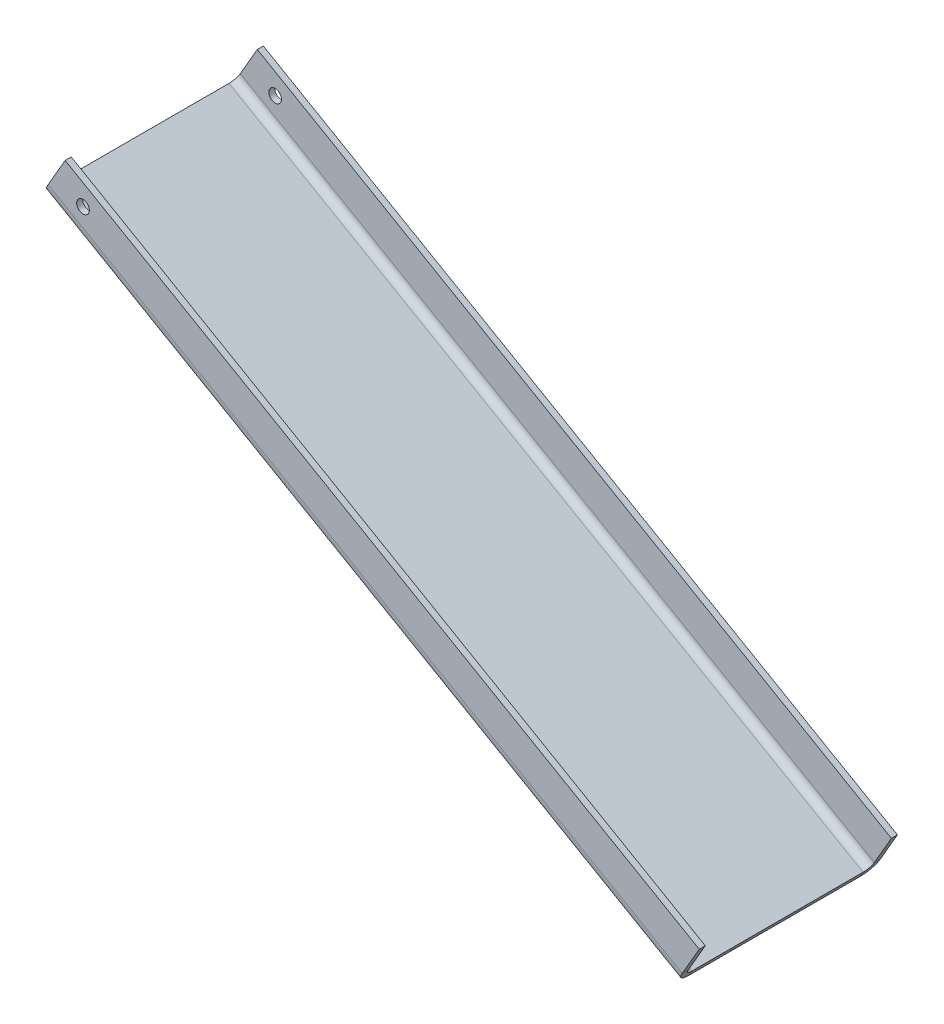
ISO-10303-21;
HEADER;
FILE_DESCRIPTION(('STEP AP214'),'2;1');
FILE_NAME('part.step','',(''),(''),'','','');
FILE_SCHEMA(('AUTOMOTIVE_DESIGN { 1 0 10303 214 1 1 1 1 }'));
ENDSEC;
DATA;
#1=APPLICATION_CONTEXT('core data for automotive mechanical design processes');
#2=APPLICATION_PROTOCOL_DEFINITION('international standard','automotive_design',2000,#1);
#3=PRODUCT_CONTEXT('',#1,'mechanical');
#4=PRODUCT('Part','Part','',(#3));
#5=PRODUCT_RELATED_PRODUCT_CATEGORY('part','',(#4));
#6=PRODUCT_DEFINITION_FORMATION('','',#4);
#7=PRODUCT_DEFINITION_CONTEXT('part definition',#1,'design');
#8=PRODUCT_DEFINITION('design','',#6,#7);
#9=PRODUCT_DEFINITION_SHAPE('','',#8);
#10=(LENGTH_UNIT() NAMED_UNIT(*) SI_UNIT(.MILLI.,.METRE.));
#11=(NAMED_UNIT(*) PLANE_ANGLE_UNIT() SI_UNIT($,.RADIAN.));
#12=(NAMED_UNIT(*) SI_UNIT($,.STERADIAN.) SOLID_ANGLE_UNIT());
#13=UNCERTAINTY_MEASURE_WITH_UNIT(LENGTH_MEASURE(1.E-05),#10,'distance_accuracy_value','');
#14=(GEOMETRIC_REPRESENTATION_CONTEXT(3) GLOBAL_UNCERTAINTY_ASSIGNED_CONTEXT((#13)) GLOBAL_UNIT_ASSIGNED_CONTEXT((#10,
#11,#12)) REPRESENTATION_CONTEXT('',''));
#15=CARTESIAN_POINT('',(0.,0.,0.));
#16=DIRECTION('',(0.,0.,1.));
#17=DIRECTION('',(1.,0.,0.));
#18=AXIS2_PLACEMENT_3D('',#15,#16,#17);
#19=CARTESIAN_POINT('',(3.60822483003176E-13,-7.07767178198537E-13,25.0000000000007));
#20=DIRECTION('',(-0.500000000000012,-0.866025403784438,0.));
#21=DIRECTION('',(0.866025403784455,-0.500000000000001,0.));
#22=AXIS2_PLACEMENT_3D('',#19,#20,#21);
#23=PLANE('',#22);
#24=DIRECTION('',(0.866025403784455,-0.500000000000002,0.));
#25=VECTOR('',#24,1.);
#26=CARTESIAN_POINT('',(160.000000000003,-92.3760430703405,21.5760800000006));
#27=LINE('',#26,#25);
#28=CARTESIAN_POINT('',(160.000000000003,-92.3760430703405,21.5760800000007));
#29=VERTEX_POINT('',#28);
#30=CARTESIAN_POINT('',(2.63677968348475E-13,0.,21.5760800000007));
#31=VERTEX_POINT('',#30);
#32=EDGE_CURVE('E234',#29,#31,#27,.F.);
#33=ORIENTED_EDGE('',*,*,#32,.F.);
#34=DIRECTION('',(0.,0.,-1.00000000000002));
#35=VECTOR('',#34,1.);
#36=CARTESIAN_POINT('',(160.000000000003,-92.3760430703404,25.0000000000007));
#37=LINE('',#36,#35);
#38=CARTESIAN_POINT('',(160.000000000003,-92.3760430703403,-21.5760800000002));
#39=VERTEX_POINT('',#38);
#40=EDGE_CURVE('E15',#29,#39,#37,.T.);
#41=ORIENTED_EDGE('',*,*,#40,.T.);
#42=DIRECTION('',(-0.866025403784456,0.5,0.));
#43=VECTOR('',#42,1.);
#44=CARTESIAN_POINT('',(0.,0.,-21.5760800000004));
#45=LINE('',#44,#43);
#46=CARTESIAN_POINT('',(0.,0.,-21.5760800000004));
#47=VERTEX_POINT('',#46);
#48=EDGE_CURVE('E285',#47,#39,#45,.F.);
#49=ORIENTED_EDGE('',*,*,#48,.F.);
#50=DIRECTION('',(0.,0.,-1.00000000000002));
#51=VECTOR('',#50,1.);
#52=CARTESIAN_POINT('',(3.60822483003176E-13,-7.07767178198537E-13,25.0000000000007));
#53=LINE('',#52,#51);
#54=EDGE_CURVE('E98',#31,#47,#53,.T.);
#55=ORIENTED_EDGE('',*,*,#54,.F.);
#56=EDGE_LOOP('',(#33,#41,#49,#55));
#57=FACE_BOUND('',#56,.T.);
#58=ADVANCED_FACE('F89',(#57),#23,.F.);
#59=CARTESIAN_POINT('',(-0.75945999999967,-1.31542330631626,25.0000000000007));
#60=DIRECTION('',(-0.500000000000012,-0.866025403784438,0.));
#61=DIRECTION('',(0.866025403784455,-0.500000000000001,0.));
#62=AXIS2_PLACEMENT_3D('',#59,#60,#61);
#63=PLANE('',#62);
#64=DIRECTION('',(0.,0.,1.00000000000002));
#65=VECTOR('',#64,1.);
#66=CARTESIAN_POINT('',(159.240540000005,-93.6914663766574,25.0000000000005));
#67=LINE('',#66,#65);
#68=CARTESIAN_POINT('',(159.240540000004,-93.6914663766574,21.5760800000004));
#69=VERTEX_POINT('',#68);
#70=CARTESIAN_POINT('',(159.240540000005,-93.6914663766567,-21.5760800000003));
#71=VERTEX_POINT('',#70);
#72=EDGE_CURVE('E295',#69,#71,#67,.F.);
#73=ORIENTED_EDGE('',*,*,#72,.F.);
#74=DIRECTION('',(0.866025403784455,-0.500000000000002,0.));
#75=VECTOR('',#74,1.);
#76=CARTESIAN_POINT('',(159.240540000004,-93.6914663766574,21.5760800000005));
#77=LINE('',#76,#75);
#78=CARTESIAN_POINT('',(-0.759459999999663,-1.31542330631623,21.5760800000007));
#79=VERTEX_POINT('',#78);
#80=EDGE_CURVE('E223',#69,#79,#77,.F.);
#81=ORIENTED_EDGE('',*,*,#80,.T.);
#82=DIRECTION('',(0.,0.,1.00000000000002));
#83=VECTOR('',#82,1.);
#84=CARTESIAN_POINT('',(-0.75945999999967,-1.31542330631626,25.0000000000007));
#85=LINE('',#84,#83);
#86=CARTESIAN_POINT('',(-0.759459999999889,-1.31542330631634,-21.5760800000003));
#87=VERTEX_POINT('',#86);
#88=EDGE_CURVE('E291',#79,#87,#85,.F.);
#89=ORIENTED_EDGE('',*,*,#88,.T.);
#90=DIRECTION('',(-0.866025403784456,0.5,0.));
#91=VECTOR('',#90,1.);
#92=CARTESIAN_POINT('',(-0.759459999999889,-1.31542330631634,-21.5760800000003));
#93=LINE('',#92,#91);
#94=EDGE_CURVE('E274',#87,#71,#93,.F.);
#95=ORIENTED_EDGE('',*,*,#94,.T.);
#96=EDGE_LOOP('',(#73,#81,#89,#95));
#97=FACE_BOUND('',#96,.T.);
#98=ADVANCED_FACE('F302',(#97),#63,.T.);
#99=CARTESIAN_POINT('',(160.000000000003,-92.3760430703404,25.0000000000007));
#100=DIRECTION('',(-0.866025403784455,0.500000000000001,0.));
#101=DIRECTION('',(0.,0.,-1.00000000000002));
#102=AXIS2_PLACEMENT_3D('',#99,#100,#101);
#103=PLANE('',#102);
#104=ORIENTED_EDGE('',*,*,#40,.F.);
#105=DIRECTION('',(-0.500000000000013,-0.866025403784438,0.));
#106=VECTOR('',#105,1.);
#107=CARTESIAN_POINT('',(160.000000000003,-92.3760430703405,21.5760800000007));
#108=LINE('',#107,#106);
#109=EDGE_CURVE('E228',#29,#69,#108,.T.);
#110=ORIENTED_EDGE('',*,*,#109,.T.);
#111=ORIENTED_EDGE('',*,*,#72,.T.);
#112=DIRECTION('',(-0.500000000000007,-0.866025403784441,0.));
#113=VECTOR('',#112,1.);
#114=CARTESIAN_POINT('',(160.000000000003,-92.3760430703403,-21.5760800000002));
#115=LINE('',#114,#113);
#116=EDGE_CURVE('E289',#39,#71,#115,.T.);
#117=ORIENTED_EDGE('',*,*,#116,.F.);
#118=EDGE_LOOP('',(#104,#110,#111,#117));
#119=FACE_BOUND('',#118,.T.);
#120=ADVANCED_FACE('F340',(#119),#103,.F.);
#121=CARTESIAN_POINT('',(3.60822483003176E-13,-7.07767178198537E-13,25.0000000000007));
#122=DIRECTION('',(-0.866025403784455,0.500000000000001,0.));
#123=DIRECTION('',(0.,0.,-1.00000000000002));
#124=AXIS2_PLACEMENT_3D('',#121,#122,#123);
#125=PLANE('',#124);
#126=DIRECTION('',(-0.50000000000001,-0.866025403784439,0.));
#127=VECTOR('',#126,1.);
#128=CARTESIAN_POINT('',(2.63677968348475E-13,0.,21.5760800000007));
#129=LINE('',#128,#127);
#130=EDGE_CURVE('E239',#31,#79,#129,.T.);
#131=ORIENTED_EDGE('',*,*,#130,.F.);
#132=ORIENTED_EDGE('',*,*,#54,.T.);
#133=DIRECTION('',(-0.500000000000011,-0.866025403784438,0.));
#134=VECTOR('',#133,1.);
#135=CARTESIAN_POINT('',(0.,0.,-21.5760800000004));
#136=LINE('',#135,#134);
#137=EDGE_CURVE('E279',#47,#87,#136,.T.);
#138=ORIENTED_EDGE('',*,*,#137,.T.);
#139=ORIENTED_EDGE('',*,*,#88,.F.);
#140=EDGE_LOOP('',(#131,#132,#138,#139));
#141=FACE_BOUND('',#140,.T.);
#142=ADVANCED_FACE('F91',(#141),#125,.T.);
#143=CARTESIAN_POINT('',(160.952500000004,-90.726264676131,-21.5760800000004));
#144=DIRECTION('',(0.866025403784456,-0.5,0.));
#145=DIRECTION('',(0.500000000000011,0.866025403784438,0.));
#146=AXIS2_PLACEMENT_3D('',#143,#144,#145);
#147=PLANE('',#146);
#148=DIRECTION('',(0.,0.,1.00000000000002));
#149=VECTOR('',#148,1.);
#150=CARTESIAN_POINT('',(160.952500000004,-90.726264676131,-25.0000000000005));
#151=LINE('',#150,#149);
#152=CARTESIAN_POINT('',(160.952500000004,-90.726264676131,-23.4810800000004));
#153=VERTEX_POINT('',#152);
#154=CARTESIAN_POINT('',(160.952500000004,-90.726264676131,-25.0000000000005));
#155=VERTEX_POINT('',#154);
#156=EDGE_CURVE('E241',#153,#155,#151,.F.);
#157=ORIENTED_EDGE('',*,*,#156,.F.);
#158=CARTESIAN_POINT('',(160.952500000004,-90.726264676131,-21.5760800000004));
#159=DIRECTION('',(-0.866025403784456,0.5,0.));
#160=DIRECTION('',(-0.500000000000011,-0.866025403784438,0.));
#161=AXIS2_PLACEMENT_3D('',#158,#159,#160);
#162=CIRCLE('',#161,1.905);
#163=EDGE_CURVE('E282',#39,#153,#162,.F.);
#164=ORIENTED_EDGE('',*,*,#163,.F.);
#165=ORIENTED_EDGE('',*,*,#116,.T.);
#166=CARTESIAN_POINT('',(160.952500000004,-90.726264676131,-21.5760800000004));
#167=DIRECTION('',(-0.866025403784456,0.5,0.));
#168=DIRECTION('',(-0.500000000000011,-0.866025403784438,0.));
#169=AXIS2_PLACEMENT_3D('',#166,#167,#168);
#170=CIRCLE('',#169,3.42392);
#171=EDGE_CURVE('E106',#71,#155,#170,.F.);
#172=ORIENTED_EDGE('',*,*,#171,.T.);
#173=EDGE_LOOP('',(#157,#164,#165,#172));
#174=FACE_BOUND('',#173,.T.);
#175=ADVANCED_FACE('F336',(#174),#147,.T.);
#176=CARTESIAN_POINT('',(0.952500000000182,1.64977839420857,-21.5760800000004));
#177=DIRECTION('',(0.866025403784456,-0.5,0.));
#178=DIRECTION('',(0.500000000000011,0.866025403784438,0.));
#179=AXIS2_PLACEMENT_3D('',#176,#177,#178);
#180=PLANE('',#179);
#181=CARTESIAN_POINT('',(0.952500000000182,1.64977839420857,-21.5760800000004));
#182=DIRECTION('',(-0.866025403784456,0.5,0.));
#183=DIRECTION('',(-0.500000000000011,-0.866025403784438,0.));
#184=AXIS2_PLACEMENT_3D('',#181,#182,#183);
#185=CIRCLE('',#184,1.905);
#186=CARTESIAN_POINT('',(0.952500000000214,1.64977839420928,-23.4810800000005));
#187=VERTEX_POINT('',#186);
#188=EDGE_CURVE('E247',#187,#47,#185,.T.);
#189=ORIENTED_EDGE('',*,*,#188,.F.);
#190=DIRECTION('',(0.,0.,1.00000000000002));
#191=VECTOR('',#190,1.);
#192=CARTESIAN_POINT('',(0.952500000000144,1.64977839420934,-23.4810800000004));
#193=LINE('',#192,#191);
#194=CARTESIAN_POINT('',(0.952500000000227,1.64977839420864,-25.0000000000004));
#195=VERTEX_POINT('',#194);
#196=EDGE_CURVE('E267',#187,#195,#193,.F.);
#197=ORIENTED_EDGE('',*,*,#196,.T.);
#198=CARTESIAN_POINT('',(0.952500000000182,1.64977839420857,-21.5760800000004));
#199=DIRECTION('',(-0.866025403784456,0.5,0.));
#200=DIRECTION('',(-0.500000000000011,-0.866025403784438,0.));
#201=AXIS2_PLACEMENT_3D('',#198,#199,#200);
#202=CIRCLE('',#201,3.42392);
#203=EDGE_CURVE('E277',#195,#87,#202,.T.);
#204=ORIENTED_EDGE('',*,*,#203,.T.);
#205=ORIENTED_EDGE('',*,*,#137,.F.);
#206=EDGE_LOOP('',(#189,#197,#204,#205));
#207=FACE_BOUND('',#206,.T.);
#208=ADVANCED_FACE('F309',(#207),#180,.F.);
#209=CARTESIAN_POINT('',(0.952500000000245,1.64977839420857,-21.5760800000005));
#210=DIRECTION('',(-0.866025403784456,0.5,0.));
#211=DIRECTION('',(0.,0.,-1.00000000000002));
#212=AXIS2_PLACEMENT_3D('',#209,#210,#211);
#213=CYLINDRICAL_SURFACE('',#212,3.42392);
#214=ORIENTED_EDGE('',*,*,#94,.F.);
#215=ORIENTED_EDGE('',*,*,#203,.F.);
#216=DIRECTION('',(-0.866025403784455,0.500000000000001,0.));
#217=VECTOR('',#216,1.);
#218=CARTESIAN_POINT('',(160.952500000004,-90.726264676131,-25.0000000000005));
#219=LINE('',#218,#217);
#220=EDGE_CURVE('E265',#195,#155,#219,.F.);
#221=ORIENTED_EDGE('',*,*,#220,.T.);
#222=ORIENTED_EDGE('',*,*,#171,.F.);
#223=EDGE_LOOP('',(#214,#215,#221,#222));
#224=FACE_BOUND('',#223,.T.);
#225=ADVANCED_FACE('F334',(#224),#213,.T.);
#226=CARTESIAN_POINT('',(0.952500000000245,1.64977839420857,-21.5760800000005));
#227=DIRECTION('',(-0.866025403784456,0.5,0.));
#228=DIRECTION('',(0.,0.,-1.00000000000002));
#229=AXIS2_PLACEMENT_3D('',#226,#227,#228);
#230=CYLINDRICAL_SURFACE('',#229,1.905);
#231=ORIENTED_EDGE('',*,*,#48,.T.);
#232=ORIENTED_EDGE('',*,*,#163,.T.);
#233=DIRECTION('',(-0.866025403784455,0.500000000000001,0.));
#234=VECTOR('',#233,1.);
#235=CARTESIAN_POINT('',(160.952500000004,-90.726264676131,-23.4810800000004));
#236=LINE('',#235,#234);
#237=EDGE_CURVE('E270',#153,#187,#236,.T.);
#238=ORIENTED_EDGE('',*,*,#237,.T.);
#239=ORIENTED_EDGE('',*,*,#188,.T.);
#240=EDGE_LOOP('',(#231,#232,#238,#239));
#241=FACE_BOUND('',#240,.T.);
#242=ADVANCED_FACE('F312',(#241),#230,.F.);
#243=CARTESIAN_POINT('',(160.000000000003,-92.3760430703404,-25.0000000000006));
#244=DIRECTION('',(-0.866025403784455,0.500000000000002,0.));
#245=DIRECTION('',(-0.500000000000013,-0.866025403784438,0.));
#246=AXIS2_PLACEMENT_3D('',#243,#244,#245);
#247=PLANE('',#246);
#248=ORIENTED_EDGE('',*,*,#156,.T.);
#249=DIRECTION('',(-0.500000000000013,-0.866025403784438,0.));
#250=VECTOR('',#249,1.);
#251=CARTESIAN_POINT('',(160.000000000003,-92.3760430703406,-25.0000000000006));
#252=LINE('',#251,#250);
#253=CARTESIAN_POINT('',(165.240540000004,-83.2991615312441,-25.0000000000006));
#254=VERTEX_POINT('',#253);
#255=EDGE_CURVE('E255',#254,#155,#252,.T.);
#256=ORIENTED_EDGE('',*,*,#255,.F.);
#257=DIRECTION('',(0.,0.,1.00000000000002));
#258=VECTOR('',#257,1.);
#259=CARTESIAN_POINT('',(165.240540000004,-83.2991615312441,-25.0000000000006));
#260=LINE('',#259,#258);
#261=CARTESIAN_POINT('',(165.240540000004,-83.2991615312441,-23.4810800000004));
#262=VERTEX_POINT('',#261);
#263=EDGE_CURVE('E248',#254,#262,#260,.T.);
#264=ORIENTED_EDGE('',*,*,#263,.T.);
#265=DIRECTION('',(0.500000000000013,0.866025403784438,0.));
#266=VECTOR('',#265,1.);
#267=CARTESIAN_POINT('',(160.000000000003,-92.3760430703404,-23.4810800000006));
#268=LINE('',#267,#266);
#269=EDGE_CURVE('E262',#262,#153,#268,.F.);
#270=ORIENTED_EDGE('',*,*,#269,.T.);
#271=EDGE_LOOP('',(#248,#256,#264,#270));
#272=FACE_BOUND('',#271,.T.);
#273=ADVANCED_FACE('F321',(#272),#247,.F.);
#274=CARTESIAN_POINT('',(5.2405400000004,9.07688153909697,-25.0000000000006));
#275=DIRECTION('',(0.866025403784454,-0.500000000000002,0.));
#276=DIRECTION('',(0.500000000000013,0.866025403784437,0.));
#277=AXIS2_PLACEMENT_3D('',#274,#275,#276);
#278=PLANE('',#277);
#279=ORIENTED_EDGE('',*,*,#196,.F.);
#280=DIRECTION('',(-0.500000000000014,-0.866025403784437,0.));
#281=VECTOR('',#280,1.);
#282=CARTESIAN_POINT('',(5.24054000000041,9.07688153909698,-23.4810800000006));
#283=LINE('',#282,#281);
#284=CARTESIAN_POINT('',(5.24054000000049,9.07688153909698,-23.4810800000006));
#285=VERTEX_POINT('',#284);
#286=EDGE_CURVE('E260',#187,#285,#283,.F.);
#287=ORIENTED_EDGE('',*,*,#286,.T.);
#288=DIRECTION('',(0.,0.,1.00000000000002));
#289=VECTOR('',#288,1.);
#290=CARTESIAN_POINT('',(5.2405400000004,9.07688153909698,-25.0000000000006));
#291=LINE('',#290,#289);
#292=CARTESIAN_POINT('',(5.2405400000004,9.07688153909698,-25.0000000000006));
#293=VERTEX_POINT('',#292);
#294=EDGE_CURVE('E244',#293,#285,#291,.T.);
#295=ORIENTED_EDGE('',*,*,#294,.F.);
#296=DIRECTION('',(0.500000000000014,0.866025403784437,0.));
#297=VECTOR('',#296,1.);
#298=CARTESIAN_POINT('',(1.45716771982052E-13,-7.91033905045424E-13,-25.0000000000004));
#299=LINE('',#298,#297);
#300=EDGE_CURVE('E253',#195,#293,#299,.T.);
#301=ORIENTED_EDGE('',*,*,#300,.F.);
#302=EDGE_LOOP('',(#279,#287,#295,#301));
#303=FACE_BOUND('',#302,.T.);
#304=ADVANCED_FACE('F330',(#303),#278,.F.);
#305=CARTESIAN_POINT('',(1.45716771982052E-13,-7.91033905045424E-13,-25.0000000000004));
#306=DIRECTION('',(0.,0.,1.00000000000002));
#307=DIRECTION('',(0.,-1.,0.));
#308=AXIS2_PLACEMENT_3D('',#305,#306,#307);
#309=PLANE('',#308);
#310=CARTESIAN_POINT('',(9.74308238468672,1.2152596747607,-25.0000000000006));
#311=DIRECTION('',(0.,0.,1.00000000000002));
#312=DIRECTION('',(1.00000000000002,0.,0.));
#313=AXIS2_PLACEMENT_3D('',#310,#311,#312);
#314=CIRCLE('',#313,1.60000000000003);
#315=CARTESIAN_POINT('',(11.3430823846868,1.2152596747607,-25.0000000000006));
#316=VERTEX_POINT('',#315);
#317=EDGE_CURVE('E429',#316,#316,#314,.T.);
#318=ORIENTED_EDGE('',*,*,#317,.T.);
#319=EDGE_LOOP('',(#318));
#320=FACE_BOUND('',#319,.T.);
#321=ORIENTED_EDGE('',*,*,#220,.F.);
#322=ORIENTED_EDGE('',*,*,#300,.T.);
#323=DIRECTION('',(0.866025403784455,-0.500000000000001,0.));
#324=VECTOR('',#323,1.);
#325=CARTESIAN_POINT('',(5.2405400000004,9.076881539097,-25.0000000000006));
#326=LINE('',#325,#324);
#327=EDGE_CURVE('E251',#293,#254,#326,.T.);
#328=ORIENTED_EDGE('',*,*,#327,.T.);
#329=ORIENTED_EDGE('',*,*,#255,.T.);
#330=EDGE_LOOP('',(#321,#322,#328,#329));
#331=FACE_BOUND('',#330,.T.);
#332=ADVANCED_FACE('F333',(#320,#331),#309,.F.);
#333=CARTESIAN_POINT('',(0.,0.,-23.4810800000004));
#334=DIRECTION('',(0.,0.,1.00000000000002));
#335=DIRECTION('',(0.,-1.,0.));
#336=AXIS2_PLACEMENT_3D('',#333,#334,#335);
#337=PLANE('',#336);
#338=CARTESIAN_POINT('',(9.74308238468685,1.2152596747607,-23.4810800000007));
#339=DIRECTION('',(0.,0.,1.00000000000002));
#340=DIRECTION('',(0.,-1.,0.));
#341=AXIS2_PLACEMENT_3D('',#338,#339,#340);
#342=CIRCLE('',#341,1.60000000000003);
#343=CARTESIAN_POINT('',(9.74308238468685,-0.384740325239328,-23.4810800000006));
#344=VERTEX_POINT('',#343);
#345=EDGE_CURVE('E222',#344,#344,#342,.T.);
#346=ORIENTED_EDGE('',*,*,#345,.F.);
#347=EDGE_LOOP('',(#346));
#348=FACE_BOUND('',#347,.T.);
#349=ORIENTED_EDGE('',*,*,#286,.F.);
#350=ORIENTED_EDGE('',*,*,#237,.F.);
#351=ORIENTED_EDGE('',*,*,#269,.F.);
#352=DIRECTION('',(-0.866025403784455,0.500000000000001,0.));
#353=VECTOR('',#352,1.);
#354=CARTESIAN_POINT('',(165.240540000004,-83.2991615312441,-23.4810800000004));
#355=LINE('',#354,#353);
#356=EDGE_CURVE('E258',#285,#262,#355,.F.);
#357=ORIENTED_EDGE('',*,*,#356,.F.);
#358=EDGE_LOOP('',(#349,#350,#351,#357));
#359=FACE_BOUND('',#358,.T.);
#360=ADVANCED_FACE('F318',(#348,#359),#337,.T.);
#361=CARTESIAN_POINT('',(165.240540000004,-83.2991615312441,-25.0000000000006));
#362=DIRECTION('',(-0.500000000000012,-0.866025403784438,0.));
#363=DIRECTION('',(0.866025403784455,-0.500000000000001,0.));
#364=AXIS2_PLACEMENT_3D('',#361,#362,#363);
#365=PLANE('',#364);
#366=ORIENTED_EDGE('',*,*,#356,.T.);
#367=ORIENTED_EDGE('',*,*,#263,.F.);
#368=ORIENTED_EDGE('',*,*,#327,.F.);
#369=ORIENTED_EDGE('',*,*,#294,.T.);
#370=EDGE_LOOP('',(#366,#367,#368,#369));
#371=FACE_BOUND('',#370,.T.);
#372=ADVANCED_FACE('F326',(#371),#365,.F.);
#373=CARTESIAN_POINT('',(0.952500000000411,1.64977839420943,21.5760800000007));
#374=DIRECTION('',(-0.866025403784455,0.500000000000002,0.));
#375=DIRECTION('',(-0.500000000000013,-0.866025403784438,0.));
#376=AXIS2_PLACEMENT_3D('',#373,#374,#375);
#377=PLANE('',#376);
#378=DIRECTION('',(0.,0.,-1.00000000000002));
#379=VECTOR('',#378,1.);
#380=CARTESIAN_POINT('',(0.952500000000332,1.64977839420935,25.0000000000007));
#381=LINE('',#380,#379);
#382=CARTESIAN_POINT('',(0.952500000000332,1.64977839420943,23.4810800000007));
#383=VERTEX_POINT('',#382);
#384=CARTESIAN_POINT('',(0.952500000000342,1.64977839420943,25.0000000000007));
#385=VERTEX_POINT('',#384);
#386=EDGE_CURVE('E204',#383,#385,#381,.F.);
#387=ORIENTED_EDGE('',*,*,#386,.F.);
#388=CARTESIAN_POINT('',(0.952500000000411,1.64977839420943,21.5760800000007));
#389=DIRECTION('',(0.866025403784455,-0.500000000000002,0.));
#390=DIRECTION('',(0.500000000000013,0.866025403784438,0.));
#391=AXIS2_PLACEMENT_3D('',#388,#389,#390);
#392=CIRCLE('',#391,1.905);
#393=EDGE_CURVE('E231',#31,#383,#392,.F.);
#394=ORIENTED_EDGE('',*,*,#393,.F.);
#395=ORIENTED_EDGE('',*,*,#130,.T.);
#396=CARTESIAN_POINT('',(0.952500000000432,1.64977839420945,21.5760800000006));
#397=DIRECTION('',(0.866025403784455,-0.500000000000002,0.));
#398=DIRECTION('',(0.500000000000013,0.866025403784438,0.));
#399=AXIS2_PLACEMENT_3D('',#396,#397,#398);
#400=CIRCLE('',#399,3.42392);
#401=EDGE_CURVE('E114',#79,#385,#400,.F.);
#402=ORIENTED_EDGE('',*,*,#401,.T.);
#403=EDGE_LOOP('',(#387,#394,#395,#402));
#404=FACE_BOUND('',#403,.T.);
#405=ADVANCED_FACE('F380',(#404),#377,.T.);
#406=CARTESIAN_POINT('',(160.952500000003,-90.7262646761311,21.5760800000003));
#407=DIRECTION('',(-0.866025403784455,0.500000000000002,0.));
#408=DIRECTION('',(-0.500000000000013,-0.866025403784438,0.));
#409=AXIS2_PLACEMENT_3D('',#406,#407,#408);
#410=PLANE('',#409);
#411=CARTESIAN_POINT('',(160.952500000003,-90.7262646761311,21.5760800000003));
#412=DIRECTION('',(0.866025403784455,-0.500000000000002,0.));
#413=DIRECTION('',(0.500000000000013,0.866025403784438,0.));
#414=AXIS2_PLACEMENT_3D('',#411,#412,#413);
#415=CIRCLE('',#414,1.905);
#416=CARTESIAN_POINT('',(160.952500000003,-90.7262646761311,23.4810800000005));
#417=VERTEX_POINT('',#416);
#418=EDGE_CURVE('E236',#417,#29,#415,.T.);
#419=ORIENTED_EDGE('',*,*,#418,.F.);
#420=DIRECTION('',(0.,0.,-1.00000000000002));
#421=VECTOR('',#420,1.);
#422=CARTESIAN_POINT('',(160.952500000004,-90.726264676131,23.4810800000004));
#423=LINE('',#422,#421);
#424=CARTESIAN_POINT('',(160.952500000003,-90.7262646761317,25.0000000000003));
#425=VERTEX_POINT('',#424);
#426=EDGE_CURVE('E216',#417,#425,#423,.F.);
#427=ORIENTED_EDGE('',*,*,#426,.T.);
#428=CARTESIAN_POINT('',(160.952500000003,-90.7262646761311,21.5760800000003));
#429=DIRECTION('',(0.866025403784455,-0.500000000000002,0.));
#430=DIRECTION('',(0.500000000000013,0.866025403784438,0.));
#431=AXIS2_PLACEMENT_3D('',#428,#429,#430);
#432=CIRCLE('',#431,3.42392);
#433=EDGE_CURVE('E226',#425,#69,#432,.T.);
#434=ORIENTED_EDGE('',*,*,#433,.T.);
#435=ORIENTED_EDGE('',*,*,#109,.F.);
#436=EDGE_LOOP('',(#419,#427,#434,#435));
#437=FACE_BOUND('',#436,.T.);
#438=ADVANCED_FACE('F343',(#437),#410,.F.);
#439=CARTESIAN_POINT('',(160.952500000003,-90.7262646761311,21.5760800000003));
#440=DIRECTION('',(0.866025403784455,-0.500000000000002,0.));
#441=DIRECTION('',(0.,0.,1.00000000000002));
#442=AXIS2_PLACEMENT_3D('',#439,#440,#441);
#443=CYLINDRICAL_SURFACE('',#442,3.42392);
#444=ORIENTED_EDGE('',*,*,#80,.F.);
#445=ORIENTED_EDGE('',*,*,#433,.F.);
#446=DIRECTION('',(0.866025403784455,-0.500000000000001,0.));
#447=VECTOR('',#446,1.);
#448=CARTESIAN_POINT('',(0.952500000000342,1.64977839420935,25.0000000000007));
#449=LINE('',#448,#447);
#450=EDGE_CURVE('E214',#425,#385,#449,.F.);
#451=ORIENTED_EDGE('',*,*,#450,.T.);
#452=ORIENTED_EDGE('',*,*,#401,.F.);
#453=EDGE_LOOP('',(#444,#445,#451,#452));
#454=FACE_BOUND('',#453,.T.);
#455=ADVANCED_FACE('F389',(#454),#443,.T.);
#456=CARTESIAN_POINT('',(160.952500000003,-90.7262646761311,21.5760800000003));
#457=DIRECTION('',(0.866025403784455,-0.500000000000002,0.));
#458=DIRECTION('',(0.,0.,1.00000000000002));
#459=AXIS2_PLACEMENT_3D('',#456,#457,#458);
#460=CYLINDRICAL_SURFACE('',#459,1.905);
#461=ORIENTED_EDGE('',*,*,#32,.T.);
#462=ORIENTED_EDGE('',*,*,#393,.T.);
#463=DIRECTION('',(0.866025403784455,-0.500000000000001,0.));
#464=VECTOR('',#463,1.);
#465=CARTESIAN_POINT('',(0.952500000000307,1.64977839420935,23.4810800000007));
#466=LINE('',#465,#464);
#467=EDGE_CURVE('E219',#383,#417,#466,.T.);
#468=ORIENTED_EDGE('',*,*,#467,.T.);
#469=ORIENTED_EDGE('',*,*,#418,.T.);
#470=EDGE_LOOP('',(#461,#462,#468,#469));
#471=FACE_BOUND('',#470,.T.);
#472=ADVANCED_FACE('F347',(#471),#460,.F.);
#473=CARTESIAN_POINT('',(165.240540000003,-83.2991615312441,25.0000000000001));
#474=DIRECTION('',(-0.866025403784455,0.500000000000001,0.));
#475=DIRECTION('',(-0.500000000000012,-0.866025403784438,0.));
#476=AXIS2_PLACEMENT_3D('',#473,#474,#475);
#477=PLANE('',#476);
#478=ORIENTED_EDGE('',*,*,#426,.F.);
#479=DIRECTION('',(-0.500000000000012,-0.866025403784438,0.));
#480=VECTOR('',#479,1.);
#481=CARTESIAN_POINT('',(165.240540000003,-83.2991615312441,23.4810800000005));
#482=LINE('',#481,#480);
#483=CARTESIAN_POINT('',(165.240540000003,-83.2991615312441,23.4810800000005));
#484=VERTEX_POINT('',#483);
#485=EDGE_CURVE('E212',#417,#484,#482,.F.);
#486=ORIENTED_EDGE('',*,*,#485,.T.);
#487=DIRECTION('',(0.,0.,-1.00000000000002));
#488=VECTOR('',#487,1.);
#489=CARTESIAN_POINT('',(165.240540000003,-83.2991615312441,25.0000000000001));
#490=LINE('',#489,#488);
#491=CARTESIAN_POINT('',(165.240540000003,-83.2991615312441,25.0000000000001));
#492=VERTEX_POINT('',#491);
#493=EDGE_CURVE('E200',#492,#484,#490,.T.);
#494=ORIENTED_EDGE('',*,*,#493,.F.);
#495=DIRECTION('',(0.500000000000012,0.866025403784438,0.));
#496=VECTOR('',#495,1.);
#497=CARTESIAN_POINT('',(160.000000000003,-92.3760430703405,25.0000000000006));
#498=LINE('',#497,#496);
#499=EDGE_CURVE('E187',#425,#492,#498,.T.);
#500=ORIENTED_EDGE('',*,*,#499,.F.);
#501=EDGE_LOOP('',(#478,#486,#494,#500));
#502=FACE_BOUND('',#501,.T.);
#503=ADVANCED_FACE('F395',(#502),#477,.F.);
#504=CARTESIAN_POINT('',(3.60822483003176E-13,-7.07767178198537E-13,25.0000000000007));
#505=DIRECTION('',(0.866025403784455,-0.500000000000001,0.));
#506=DIRECTION('',(0.500000000000012,0.866025403784438,0.));
#507=AXIS2_PLACEMENT_3D('',#504,#505,#506);
#508=PLANE('',#507);
#509=ORIENTED_EDGE('',*,*,#386,.T.);
#510=DIRECTION('',(-0.500000000000012,-0.866025403784438,0.));
#511=VECTOR('',#510,1.);
#512=CARTESIAN_POINT('',(3.43475248243408E-13,-7.7715611723761E-13,25.0000000000008));
#513=LINE('',#512,#511);
#514=CARTESIAN_POINT('',(5.24054000000042,9.076881539097,25.0000000000008));
#515=VERTEX_POINT('',#514);
#516=EDGE_CURVE('E185',#515,#385,#513,.T.);
#517=ORIENTED_EDGE('',*,*,#516,.F.);
#518=DIRECTION('',(0.,0.,-1.00000000000002));
#519=VECTOR('',#518,1.);
#520=CARTESIAN_POINT('',(5.24054000000042,9.076881539097,25.0000000000008));
#521=LINE('',#520,#519);
#522=CARTESIAN_POINT('',(5.24054000000055,9.07688153909629,23.4810800000007));
#523=VERTEX_POINT('',#522);
#524=EDGE_CURVE('E193',#515,#523,#521,.T.);
#525=ORIENTED_EDGE('',*,*,#524,.T.);
#526=DIRECTION('',(0.500000000000012,0.866025403784438,0.));
#527=VECTOR('',#526,1.);
#528=CARTESIAN_POINT('',(4.09394740330526E-13,0.,23.4810800000008));
#529=LINE('',#528,#527);
#530=EDGE_CURVE('E209',#523,#383,#529,.F.);
#531=ORIENTED_EDGE('',*,*,#530,.T.);
#532=EDGE_LOOP('',(#509,#517,#525,#531));
#533=FACE_BOUND('',#532,.T.);
#534=ADVANCED_FACE('F203',(#533),#508,.F.);
#535=CARTESIAN_POINT('',(3.43475248243408E-13,-7.7715611723761E-13,25.0000000000008));
#536=DIRECTION('',(0.,0.,-1.00000000000002));
#537=DIRECTION('',(0.,1.,0.));
#538=AXIS2_PLACEMENT_3D('',#535,#536,#537);
#539=PLANE('',#538);
#540=CARTESIAN_POINT('',(9.74308238468688,1.2152596747607,25.0000000000007));
#541=DIRECTION('',(0.,0.,-1.00000000000002));
#542=DIRECTION('',(0.,1.,0.));
#543=AXIS2_PLACEMENT_3D('',#540,#541,#542);
#544=CIRCLE('',#543,1.60000000000003);
#545=CARTESIAN_POINT('',(9.74308238468688,2.81525967476073,25.0000000000007));
#546=VERTEX_POINT('',#545);
#547=EDGE_CURVE('E425',#546,#546,#544,.T.);
#548=ORIENTED_EDGE('',*,*,#547,.T.);
#549=EDGE_LOOP('',(#548));
#550=FACE_BOUND('',#549,.T.);
#551=ORIENTED_EDGE('',*,*,#450,.F.);
#552=ORIENTED_EDGE('',*,*,#499,.T.);
#553=DIRECTION('',(-0.866025403784455,0.500000000000001,0.));
#554=VECTOR('',#553,1.);
#555=CARTESIAN_POINT('',(5.24054000000042,9.076881539097,25.0000000000008));
#556=LINE('',#555,#554);
#557=EDGE_CURVE('E180',#492,#515,#556,.T.);
#558=ORIENTED_EDGE('',*,*,#557,.T.);
#559=ORIENTED_EDGE('',*,*,#516,.T.);
#560=EDGE_LOOP('',(#551,#552,#558,#559));
#561=FACE_BOUND('',#560,.T.);
#562=ADVANCED_FACE('F183',(#550,#561),#539,.F.);
#563=CARTESIAN_POINT('',(3.64291929955129E-13,0.,23.4810800000007));
#564=DIRECTION('',(0.,0.,-1.00000000000002));
#565=DIRECTION('',(0.,1.,0.));
#566=AXIS2_PLACEMENT_3D('',#563,#564,#565);
#567=PLANE('',#566);
#568=CARTESIAN_POINT('',(9.7430823846869,1.21525967476141,23.4810800000007));
#569=DIRECTION('',(0.,0.,-1.00000000000002));
#570=DIRECTION('',(0.,1.,0.));
#571=AXIS2_PLACEMENT_3D('',#568,#569,#570);
#572=CIRCLE('',#571,1.60000000000003);
#573=CARTESIAN_POINT('',(9.7430823846869,2.81525967476144,23.4810800000007));
#574=VERTEX_POINT('',#573);
#575=EDGE_CURVE('E93',#574,#574,#572,.T.);
#576=ORIENTED_EDGE('',*,*,#575,.F.);
#577=EDGE_LOOP('',(#576));
#578=FACE_BOUND('',#577,.T.);
#579=ORIENTED_EDGE('',*,*,#485,.F.);
#580=ORIENTED_EDGE('',*,*,#467,.F.);
#581=ORIENTED_EDGE('',*,*,#530,.F.);
#582=DIRECTION('',(0.866025403784455,-0.500000000000001,0.));
#583=VECTOR('',#582,1.);
#584=CARTESIAN_POINT('',(5.24054000000055,9.07688153909629,23.4810800000007));
#585=LINE('',#584,#583);
#586=EDGE_CURVE('E196',#484,#523,#585,.F.);
#587=ORIENTED_EDGE('',*,*,#586,.F.);
#588=EDGE_LOOP('',(#579,#580,#581,#587));
#589=FACE_BOUND('',#588,.T.);
#590=ADVANCED_FACE('F404',(#578,#589),#567,.T.);
#591=CARTESIAN_POINT('',(5.24054000000042,9.076881539097,25.0000000000008));
#592=DIRECTION('',(-0.500000000000012,-0.866025403784438,0.));
#593=DIRECTION('',(0.866025403784455,-0.500000000000001,0.));
#594=AXIS2_PLACEMENT_3D('',#591,#592,#593);
#595=PLANE('',#594);
#596=ORIENTED_EDGE('',*,*,#586,.T.);
#597=ORIENTED_EDGE('',*,*,#524,.F.);
#598=ORIENTED_EDGE('',*,*,#557,.F.);
#599=ORIENTED_EDGE('',*,*,#493,.T.);
#600=EDGE_LOOP('',(#596,#597,#598,#599));
#601=FACE_BOUND('',#600,.T.);
#602=ADVANCED_FACE('F194',(#601),#595,.F.);
#603=CARTESIAN_POINT('',(9.74308238468672,1.2152596747607,-25.0000000000006));
#604=DIRECTION('',(0.,0.,1.00000000000002));
#605=DIRECTION('',(1.00000000000002,0.,0.));
#606=AXIS2_PLACEMENT_3D('',#603,#604,#605);
#607=CYLINDRICAL_SURFACE('',#606,1.60000000000003);
#608=ORIENTED_EDGE('',*,*,#575,.T.);
#609=EDGE_LOOP('',(#608));
#610=FACE_BOUND('',#609,.T.);
#611=ORIENTED_EDGE('',*,*,#547,.F.);
#612=EDGE_LOOP('',(#611));
#613=FACE_BOUND('',#612,.T.);
#614=ADVANCED_FACE('F403',(#610,#613),#607,.F.);
#615=ORIENTED_EDGE('',*,*,#345,.T.);
#616=EDGE_LOOP('',(#615));
#617=FACE_BOUND('',#616,.T.);
#618=ORIENTED_EDGE('',*,*,#317,.F.);
#619=EDGE_LOOP('',(#618));
#620=FACE_BOUND('',#619,.T.);
#621=ADVANCED_FACE('F414',(#617,#620),#607,.F.);
#622=CLOSED_SHELL('',(#58,#98,#120,#142,#175,#208,#225,#242,#273,#304,#332,#360,#372,#405,#438,
#455,#472,#503,#534,#562,#590,#602,#614,#621));
#623=MANIFOLD_SOLID_BREP('B2',#622);
#624=ADVANCED_BREP_SHAPE_REPRESENTATION('',(#18,#623),#14);
#625=SHAPE_DEFINITION_REPRESENTATION(#9,#624);
ENDSEC;
END-ISO-10303-21;
